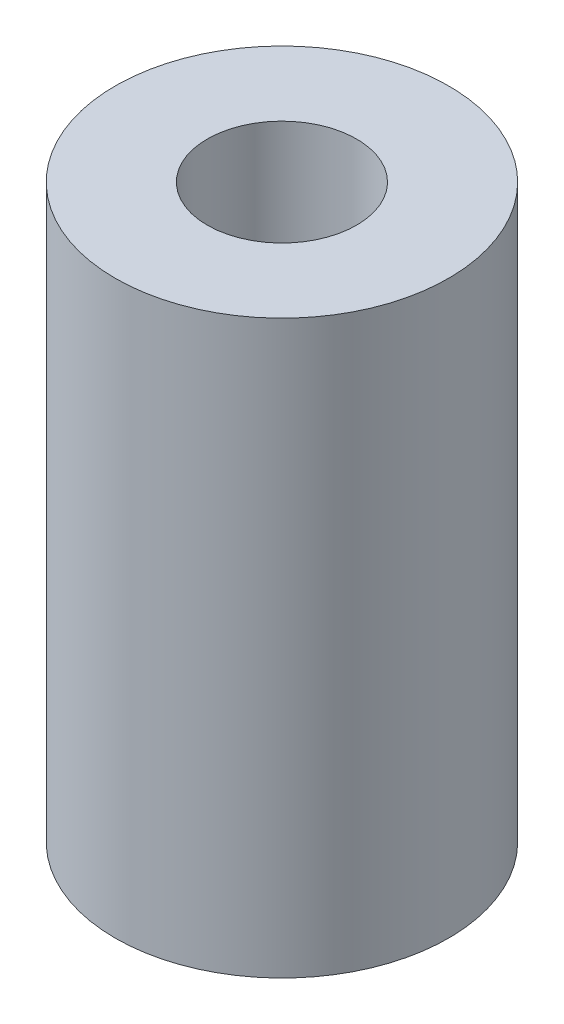
ISO-10303-21;
HEADER;
FILE_DESCRIPTION(('STEP AP214'),'2;1');
FILE_NAME('part.step','',(''),(''),'','','');
FILE_SCHEMA(('AUTOMOTIVE_DESIGN { 1 0 10303 214 1 1 1 1 }'));
ENDSEC;
DATA;
#1=APPLICATION_CONTEXT('core data for automotive mechanical design processes');
#2=APPLICATION_PROTOCOL_DEFINITION('international standard','automotive_design',2000,#1);
#3=PRODUCT_CONTEXT('',#1,'mechanical');
#4=PRODUCT('Part','Part','',(#3));
#5=PRODUCT_RELATED_PRODUCT_CATEGORY('part','',(#4));
#6=PRODUCT_DEFINITION_FORMATION('','',#4);
#7=PRODUCT_DEFINITION_CONTEXT('part definition',#1,'design');
#8=PRODUCT_DEFINITION('design','',#6,#7);
#9=PRODUCT_DEFINITION_SHAPE('','',#8);
#10=(LENGTH_UNIT() NAMED_UNIT(*) SI_UNIT(.MILLI.,.METRE.));
#11=(NAMED_UNIT(*) PLANE_ANGLE_UNIT() SI_UNIT($,.RADIAN.));
#12=(NAMED_UNIT(*) SI_UNIT($,.STERADIAN.) SOLID_ANGLE_UNIT());
#13=UNCERTAINTY_MEASURE_WITH_UNIT(LENGTH_MEASURE(1.E-05),#10,'distance_accuracy_value','');
#14=(GEOMETRIC_REPRESENTATION_CONTEXT(3) GLOBAL_UNCERTAINTY_ASSIGNED_CONTEXT((#13)) GLOBAL_UNIT_ASSIGNED_CONTEXT((#10,
#11,#12)) REPRESENTATION_CONTEXT('',''));
#15=CARTESIAN_POINT('',(0.,0.,0.));
#16=DIRECTION('',(0.,0.,1.));
#17=DIRECTION('',(1.,0.,0.));
#18=AXIS2_PLACEMENT_3D('',#15,#16,#17);
#19=CARTESIAN_POINT('',(0.,26.4,0.));
#20=DIRECTION('',(0.,1.,0.));
#21=DIRECTION('',(0.,0.,1.));
#22=AXIS2_PLACEMENT_3D('',#19,#20,#21);
#23=PLANE('',#22);
#24=CARTESIAN_POINT('',(0.,26.4,0.));
#25=DIRECTION('',(0.,1.,0.));
#26=DIRECTION('',(0.,0.,1.));
#27=AXIS2_PLACEMENT_3D('',#24,#25,#26);
#28=CIRCLE('',#27,7.7);
#29=CARTESIAN_POINT('',(0.,26.4,7.7));
#30=VERTEX_POINT('',#29);
#31=EDGE_CURVE('E10',#30,#30,#28,.T.);
#32=ORIENTED_EDGE('',*,*,#31,.T.);
#33=EDGE_LOOP('',(#32));
#34=FACE_BOUND('',#33,.T.);
#35=CARTESIAN_POINT('',(0.,26.4,0.));
#36=DIRECTION('',(0.,1.,0.));
#37=DIRECTION('',(0.,0.,1.));
#38=AXIS2_PLACEMENT_3D('',#35,#36,#37);
#39=CIRCLE('',#38,3.45);
#40=CARTESIAN_POINT('',(0.,26.4,3.45));
#41=VERTEX_POINT('',#40);
#42=EDGE_CURVE('E44',#41,#41,#39,.T.);
#43=ORIENTED_EDGE('',*,*,#42,.F.);
#44=EDGE_LOOP('',(#43));
#45=FACE_BOUND('',#44,.T.);
#46=ADVANCED_FACE('F33',(#34,#45),#23,.T.);
#47=CARTESIAN_POINT('',(0.,0.,0.));
#48=DIRECTION('',(0.,1.,0.));
#49=DIRECTION('',(0.,0.,1.));
#50=AXIS2_PLACEMENT_3D('',#47,#48,#49);
#51=PLANE('',#50);
#52=CARTESIAN_POINT('',(0.,0.,0.));
#53=DIRECTION('',(0.,1.,0.));
#54=DIRECTION('',(0.,0.,1.));
#55=AXIS2_PLACEMENT_3D('',#52,#53,#54);
#56=CIRCLE('',#55,7.7);
#57=CARTESIAN_POINT('',(0.,0.,7.7));
#58=VERTEX_POINT('',#57);
#59=EDGE_CURVE('E37',#58,#58,#56,.T.);
#60=ORIENTED_EDGE('',*,*,#59,.F.);
#61=EDGE_LOOP('',(#60));
#62=FACE_BOUND('',#61,.T.);
#63=CARTESIAN_POINT('',(0.,0.,0.));
#64=DIRECTION('',(0.,1.,0.));
#65=DIRECTION('',(0.,0.,1.));
#66=AXIS2_PLACEMENT_3D('',#63,#64,#65);
#67=CIRCLE('',#66,3.45);
#68=CARTESIAN_POINT('',(0.,0.,3.45));
#69=VERTEX_POINT('',#68);
#70=EDGE_CURVE('E46',#69,#69,#67,.T.);
#71=ORIENTED_EDGE('',*,*,#70,.T.);
#72=EDGE_LOOP('',(#71));
#73=FACE_BOUND('',#72,.T.);
#74=ADVANCED_FACE('F56',(#62,#73),#51,.F.);
#75=CARTESIAN_POINT('',(0.,26.4,0.));
#76=DIRECTION('',(0.,-1.,0.));
#77=DIRECTION('',(0.,0.,-1.));
#78=AXIS2_PLACEMENT_3D('',#75,#76,#77);
#79=CYLINDRICAL_SURFACE('',#78,7.7);
#80=ORIENTED_EDGE('',*,*,#31,.F.);
#81=EDGE_LOOP('',(#80));
#82=FACE_BOUND('',#81,.T.);
#83=ORIENTED_EDGE('',*,*,#59,.T.);
#84=EDGE_LOOP('',(#83));
#85=FACE_BOUND('',#84,.T.);
#86=ADVANCED_FACE('F35',(#82,#85),#79,.T.);
#87=CARTESIAN_POINT('',(0.,26.4,0.));
#88=DIRECTION('',(0.,-1.,0.));
#89=DIRECTION('',(0.,0.,-1.));
#90=AXIS2_PLACEMENT_3D('',#87,#88,#89);
#91=CYLINDRICAL_SURFACE('',#90,3.45);
#92=ORIENTED_EDGE('',*,*,#42,.T.);
#93=EDGE_LOOP('',(#92));
#94=FACE_BOUND('',#93,.T.);
#95=ORIENTED_EDGE('',*,*,#70,.F.);
#96=EDGE_LOOP('',(#95));
#97=FACE_BOUND('',#96,.T.);
#98=ADVANCED_FACE('F52',(#94,#97),#91,.F.);
#99=CLOSED_SHELL('',(#46,#74,#86,#98));
#100=MANIFOLD_SOLID_BREP('B2',#99);
#101=ADVANCED_BREP_SHAPE_REPRESENTATION('',(#18,#100),#14);
#102=SHAPE_DEFINITION_REPRESENTATION(#9,#101);
ENDSEC;
END-ISO-10303-21;
